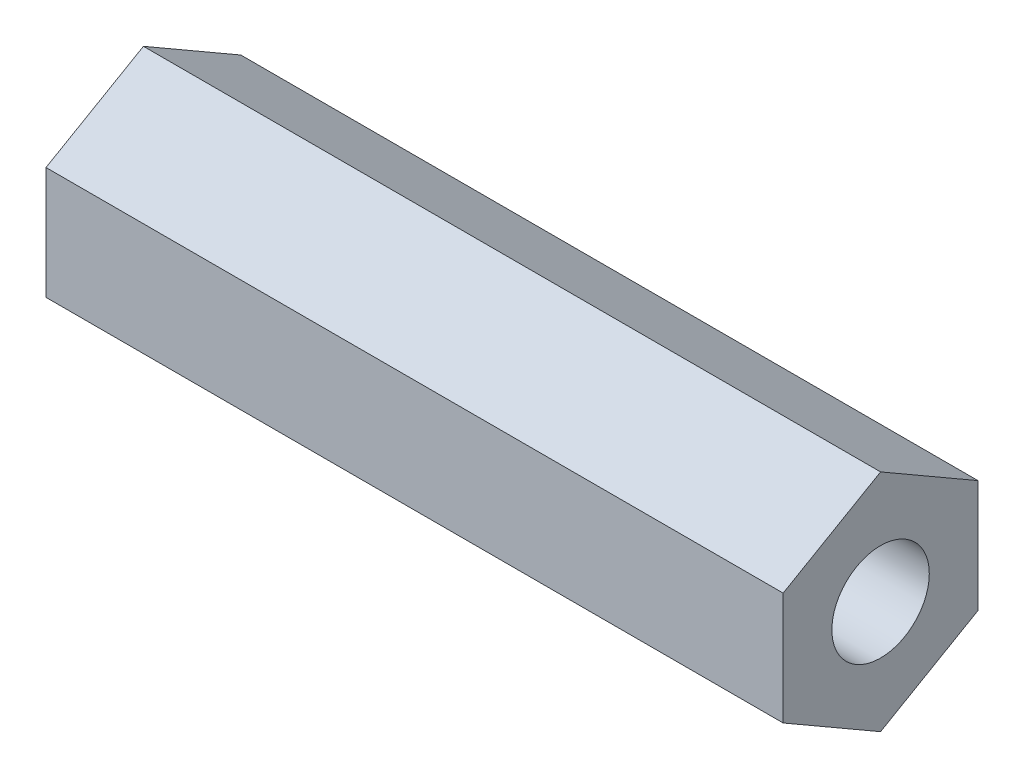
ISO-10303-21;
HEADER;
FILE_DESCRIPTION(('STEP AP214'),'2;1');
FILE_NAME('part.step','',(''),(''),'','','');
FILE_SCHEMA(('AUTOMOTIVE_DESIGN { 1 0 10303 214 1 1 1 1 }'));
ENDSEC;
DATA;
#1=APPLICATION_CONTEXT('core data for automotive mechanical design processes');
#2=APPLICATION_PROTOCOL_DEFINITION('international standard','automotive_design',2000,#1);
#3=PRODUCT_CONTEXT('',#1,'mechanical');
#4=PRODUCT('Part','Part','',(#3));
#5=PRODUCT_RELATED_PRODUCT_CATEGORY('part','',(#4));
#6=PRODUCT_DEFINITION_FORMATION('','',#4);
#7=PRODUCT_DEFINITION_CONTEXT('part definition',#1,'design');
#8=PRODUCT_DEFINITION('design','',#6,#7);
#9=PRODUCT_DEFINITION_SHAPE('','',#8);
#10=(LENGTH_UNIT() NAMED_UNIT(*) SI_UNIT(.MILLI.,.METRE.));
#11=(NAMED_UNIT(*) PLANE_ANGLE_UNIT() SI_UNIT($,.RADIAN.));
#12=(NAMED_UNIT(*) SI_UNIT($,.STERADIAN.) SOLID_ANGLE_UNIT());
#13=UNCERTAINTY_MEASURE_WITH_UNIT(LENGTH_MEASURE(1.E-05),#10,'distance_accuracy_value','');
#14=(GEOMETRIC_REPRESENTATION_CONTEXT(3) GLOBAL_UNCERTAINTY_ASSIGNED_CONTEXT((#13)) GLOBAL_UNIT_ASSIGNED_CONTEXT((#10,
#11,#12)) REPRESENTATION_CONTEXT('',''));
#15=CARTESIAN_POINT('',(0.,0.,0.));
#16=DIRECTION('',(0.,0.,1.));
#17=DIRECTION('',(1.,0.,0.));
#18=AXIS2_PLACEMENT_3D('',#15,#16,#17);
#19=CARTESIAN_POINT('',(22.7,0.,0.));
#20=DIRECTION('',(1.,0.,0.));
#21=DIRECTION('',(0.,0.,-1.));
#22=AXIS2_PLACEMENT_3D('',#19,#20,#21);
#23=PLANE('',#22);
#24=DIRECTION('',(0.,0.5,0.866025403784438));
#25=VECTOR('',#24,1.);
#26=CARTESIAN_POINT('',(22.7,6.54507984553655,39.7283363635929));
#27=LINE('',#26,#25);
#28=CARTESIAN_POINT('',(22.7,6.54507984553655,39.7283363635929));
#29=VERTEX_POINT('',#28);
#30=CARTESIAN_POINT('',(22.7,8.27713065310544,42.7283363635929));
#31=VERTEX_POINT('',#30);
#32=EDGE_CURVE('E146',#29,#31,#27,.T.);
#33=ORIENTED_EDGE('',*,*,#32,.T.);
#34=DIRECTION('',(0.,-0.500000000000001,0.866025403784438));
#35=VECTOR('',#34,1.);
#36=CARTESIAN_POINT('',(22.7,8.27713065310544,42.7283363635929));
#37=LINE('',#36,#35);
#38=CARTESIAN_POINT('',(22.7,6.54507984553656,45.7283363635929));
#39=VERTEX_POINT('',#38);
#40=EDGE_CURVE('E94',#31,#39,#37,.T.);
#41=ORIENTED_EDGE('',*,*,#40,.T.);
#42=DIRECTION('',(0.,-1.,0.));
#43=VECTOR('',#42,1.);
#44=CARTESIAN_POINT('',(22.7,6.54507984553656,45.7283363635929));
#45=LINE('',#44,#43);
#46=CARTESIAN_POINT('',(22.7,3.08097823039881,45.7283363635929));
#47=VERTEX_POINT('',#46);
#48=EDGE_CURVE('E107',#39,#47,#45,.T.);
#49=ORIENTED_EDGE('',*,*,#48,.T.);
#50=DIRECTION('',(0.,-0.5,-0.866025403784439));
#51=VECTOR('',#50,1.);
#52=CARTESIAN_POINT('',(22.7,3.08097823039881,45.7283363635929));
#53=LINE('',#52,#51);
#54=CARTESIAN_POINT('',(22.7,1.34892742282993,42.7283363635929));
#55=VERTEX_POINT('',#54);
#56=EDGE_CURVE('E101',#47,#55,#53,.T.);
#57=ORIENTED_EDGE('',*,*,#56,.T.);
#58=DIRECTION('',(0.,0.5,-0.866025403784439));
#59=VECTOR('',#58,1.);
#60=CARTESIAN_POINT('',(22.7,1.34892742282993,42.7283363635929));
#61=LINE('',#60,#59);
#62=CARTESIAN_POINT('',(22.7,3.0809782303988,39.7283363635929));
#63=VERTEX_POINT('',#62);
#64=EDGE_CURVE('E105',#55,#63,#61,.T.);
#65=ORIENTED_EDGE('',*,*,#64,.T.);
#66=DIRECTION('',(0.,1.,0.));
#67=VECTOR('',#66,1.);
#68=CARTESIAN_POINT('',(22.7,3.0809782303988,39.7283363635929));
#69=LINE('',#68,#67);
#70=EDGE_CURVE('E57',#63,#29,#69,.T.);
#71=ORIENTED_EDGE('',*,*,#70,.T.);
#72=EDGE_LOOP('',(#33,#41,#49,#57,#65,#71));
#73=FACE_BOUND('',#72,.T.);
#74=CARTESIAN_POINT('',(22.7,4.81302903796769,42.7283363635929));
#75=DIRECTION('',(1.,0.,0.));
#76=DIRECTION('',(0.,0.,-1.));
#77=AXIS2_PLACEMENT_3D('',#74,#75,#76);
#78=CIRCLE('',#77,1.5);
#79=CARTESIAN_POINT('',(22.7,4.81302903796769,41.2283363635929));
#80=VERTEX_POINT('',#79);
#81=EDGE_CURVE('E134',#80,#80,#78,.T.);
#82=ORIENTED_EDGE('',*,*,#81,.F.);
#83=EDGE_LOOP('',(#82));
#84=FACE_BOUND('',#83,.T.);
#85=ADVANCED_FACE('F39',(#73,#84),#23,.T.);
#86=CARTESIAN_POINT('',(0.,0.,0.));
#87=DIRECTION('',(1.,0.,0.));
#88=DIRECTION('',(0.,0.,-1.));
#89=AXIS2_PLACEMENT_3D('',#86,#87,#88);
#90=PLANE('',#89);
#91=DIRECTION('',(0.,0.5,0.866025403784438));
#92=VECTOR('',#91,1.);
#93=CARTESIAN_POINT('',(0.,6.54507984553655,39.7283363635929));
#94=LINE('',#93,#92);
#95=CARTESIAN_POINT('',(0.,6.54507984553655,39.7283363635929));
#96=VERTEX_POINT('',#95);
#97=CARTESIAN_POINT('',(0.,8.27713065310544,42.7283363635929));
#98=VERTEX_POINT('',#97);
#99=EDGE_CURVE('E129',#96,#98,#94,.T.);
#100=ORIENTED_EDGE('',*,*,#99,.F.);
#101=DIRECTION('',(0.,1.,0.));
#102=VECTOR('',#101,1.);
#103=CARTESIAN_POINT('',(0.,3.0809782303988,39.7283363635929));
#104=LINE('',#103,#102);
#105=CARTESIAN_POINT('',(0.,3.0809782303988,39.7283363635929));
#106=VERTEX_POINT('',#105);
#107=EDGE_CURVE('E86',#106,#96,#104,.T.);
#108=ORIENTED_EDGE('',*,*,#107,.F.);
#109=DIRECTION('',(0.,0.5,-0.866025403784439));
#110=VECTOR('',#109,1.);
#111=CARTESIAN_POINT('',(0.,1.34892742282993,42.7283363635929));
#112=LINE('',#111,#110);
#113=CARTESIAN_POINT('',(0.,1.34892742282993,42.7283363635929));
#114=VERTEX_POINT('',#113);
#115=EDGE_CURVE('E80',#114,#106,#112,.T.);
#116=ORIENTED_EDGE('',*,*,#115,.F.);
#117=DIRECTION('',(0.,-0.5,-0.866025403784439));
#118=VECTOR('',#117,1.);
#119=CARTESIAN_POINT('',(0.,3.08097823039881,45.7283363635929));
#120=LINE('',#119,#118);
#121=CARTESIAN_POINT('',(0.,3.08097823039881,45.7283363635929));
#122=VERTEX_POINT('',#121);
#123=EDGE_CURVE('E116',#122,#114,#120,.T.);
#124=ORIENTED_EDGE('',*,*,#123,.F.);
#125=DIRECTION('',(0.,-1.,0.));
#126=VECTOR('',#125,1.);
#127=CARTESIAN_POINT('',(0.,6.54507984553656,45.7283363635929));
#128=LINE('',#127,#126);
#129=CARTESIAN_POINT('',(0.,6.54507984553656,45.7283363635929));
#130=VERTEX_POINT('',#129);
#131=EDGE_CURVE('E137',#130,#122,#128,.T.);
#132=ORIENTED_EDGE('',*,*,#131,.F.);
#133=DIRECTION('',(0.,-0.500000000000001,0.866025403784438));
#134=VECTOR('',#133,1.);
#135=CARTESIAN_POINT('',(0.,8.27713065310544,42.7283363635929));
#136=LINE('',#135,#134);
#137=EDGE_CURVE('E133',#98,#130,#136,.T.);
#138=ORIENTED_EDGE('',*,*,#137,.F.);
#139=EDGE_LOOP('',(#100,#108,#116,#124,#132,#138));
#140=FACE_BOUND('',#139,.T.);
#141=CARTESIAN_POINT('',(0.,4.81302903796769,42.7283363635929));
#142=DIRECTION('',(1.,0.,0.));
#143=DIRECTION('',(0.,0.,-1.));
#144=AXIS2_PLACEMENT_3D('',#141,#142,#143);
#145=CIRCLE('',#144,1.5);
#146=CARTESIAN_POINT('',(0.,4.81302903796769,41.2283363635929));
#147=VERTEX_POINT('',#146);
#148=EDGE_CURVE('E243',#147,#147,#145,.T.);
#149=ORIENTED_EDGE('',*,*,#148,.T.);
#150=EDGE_LOOP('',(#149));
#151=FACE_BOUND('',#150,.T.);
#152=ADVANCED_FACE('F159',(#140,#151),#90,.F.);
#153=CARTESIAN_POINT('',(22.7,6.54507984553655,39.7283363635929));
#154=DIRECTION('',(0.,-0.866025403784438,0.5));
#155=DIRECTION('',(0.,-0.5,-0.866025403784439));
#156=AXIS2_PLACEMENT_3D('',#153,#154,#155);
#157=PLANE('',#156);
#158=ORIENTED_EDGE('',*,*,#99,.T.);
#159=DIRECTION('',(-1.,0.,0.));
#160=VECTOR('',#159,1.);
#161=CARTESIAN_POINT('',(22.7,8.27713065310544,42.7283363635929));
#162=LINE('',#161,#160);
#163=EDGE_CURVE('E11',#31,#98,#162,.T.);
#164=ORIENTED_EDGE('',*,*,#163,.F.);
#165=ORIENTED_EDGE('',*,*,#32,.F.);
#166=DIRECTION('',(-1.,0.,0.));
#167=VECTOR('',#166,1.);
#168=CARTESIAN_POINT('',(22.7,6.54507984553655,39.7283363635929));
#169=LINE('',#168,#167);
#170=EDGE_CURVE('E125',#29,#96,#169,.T.);
#171=ORIENTED_EDGE('',*,*,#170,.T.);
#172=EDGE_LOOP('',(#158,#164,#165,#171));
#173=FACE_BOUND('',#172,.T.);
#174=ADVANCED_FACE('F41',(#173),#157,.F.);
#175=CARTESIAN_POINT('',(22.7,8.27713065310544,42.7283363635929));
#176=DIRECTION('',(0.,-0.866025403784438,-0.500000000000001));
#177=DIRECTION('',(0.,0.500000000000001,-0.866025403784438));
#178=AXIS2_PLACEMENT_3D('',#175,#176,#177);
#179=PLANE('',#178);
#180=ORIENTED_EDGE('',*,*,#137,.T.);
#181=DIRECTION('',(-1.,0.,0.));
#182=VECTOR('',#181,1.);
#183=CARTESIAN_POINT('',(22.7,6.54507984553656,45.7283363635929));
#184=LINE('',#183,#182);
#185=EDGE_CURVE('E49',#39,#130,#184,.T.);
#186=ORIENTED_EDGE('',*,*,#185,.F.);
#187=ORIENTED_EDGE('',*,*,#40,.F.);
#188=ORIENTED_EDGE('',*,*,#163,.T.);
#189=EDGE_LOOP('',(#180,#186,#187,#188));
#190=FACE_BOUND('',#189,.T.);
#191=ADVANCED_FACE('F184',(#190),#179,.F.);
#192=CARTESIAN_POINT('',(22.7,6.54507984553656,45.7283363635929));
#193=DIRECTION('',(0.,0.,-1.));
#194=DIRECTION('',(-1.,0.,0.));
#195=AXIS2_PLACEMENT_3D('',#192,#193,#194);
#196=PLANE('',#195);
#197=ORIENTED_EDGE('',*,*,#131,.T.);
#198=DIRECTION('',(-1.,0.,0.));
#199=VECTOR('',#198,1.);
#200=CARTESIAN_POINT('',(22.7,3.08097823039881,45.7283363635929));
#201=LINE('',#200,#199);
#202=EDGE_CURVE('E118',#47,#122,#201,.T.);
#203=ORIENTED_EDGE('',*,*,#202,.F.);
#204=ORIENTED_EDGE('',*,*,#48,.F.);
#205=ORIENTED_EDGE('',*,*,#185,.T.);
#206=EDGE_LOOP('',(#197,#203,#204,#205));
#207=FACE_BOUND('',#206,.T.);
#208=ADVANCED_FACE('F156',(#207),#196,.F.);
#209=CARTESIAN_POINT('',(22.7,3.08097823039881,45.7283363635929));
#210=DIRECTION('',(0.,0.866025403784439,-0.5));
#211=DIRECTION('',(0.,0.5,0.866025403784439));
#212=AXIS2_PLACEMENT_3D('',#209,#210,#211);
#213=PLANE('',#212);
#214=ORIENTED_EDGE('',*,*,#123,.T.);
#215=DIRECTION('',(-1.,0.,0.));
#216=VECTOR('',#215,1.);
#217=CARTESIAN_POINT('',(22.7,1.34892742282993,42.7283363635929));
#218=LINE('',#217,#216);
#219=EDGE_CURVE('E113',#55,#114,#218,.T.);
#220=ORIENTED_EDGE('',*,*,#219,.F.);
#221=ORIENTED_EDGE('',*,*,#56,.F.);
#222=ORIENTED_EDGE('',*,*,#202,.T.);
#223=EDGE_LOOP('',(#214,#220,#221,#222));
#224=FACE_BOUND('',#223,.T.);
#225=ADVANCED_FACE('F114',(#224),#213,.F.);
#226=CARTESIAN_POINT('',(22.7,1.34892742282993,42.7283363635929));
#227=DIRECTION('',(0.,0.866025403784439,0.5));
#228=DIRECTION('',(0.,-0.5,0.866025403784439));
#229=AXIS2_PLACEMENT_3D('',#226,#227,#228);
#230=PLANE('',#229);
#231=ORIENTED_EDGE('',*,*,#115,.T.);
#232=DIRECTION('',(-1.,0.,0.));
#233=VECTOR('',#232,1.);
#234=CARTESIAN_POINT('',(22.7,3.0809782303988,39.7283363635929));
#235=LINE('',#234,#233);
#236=EDGE_CURVE('E119',#63,#106,#235,.T.);
#237=ORIENTED_EDGE('',*,*,#236,.F.);
#238=ORIENTED_EDGE('',*,*,#64,.F.);
#239=ORIENTED_EDGE('',*,*,#219,.T.);
#240=EDGE_LOOP('',(#231,#237,#238,#239));
#241=FACE_BOUND('',#240,.T.);
#242=ADVANCED_FACE('F121',(#241),#230,.F.);
#243=CARTESIAN_POINT('',(22.7,3.0809782303988,39.7283363635929));
#244=DIRECTION('',(0.,0.,1.));
#245=DIRECTION('',(1.,0.,0.));
#246=AXIS2_PLACEMENT_3D('',#243,#244,#245);
#247=PLANE('',#246);
#248=ORIENTED_EDGE('',*,*,#107,.T.);
#249=ORIENTED_EDGE('',*,*,#170,.F.);
#250=ORIENTED_EDGE('',*,*,#70,.F.);
#251=ORIENTED_EDGE('',*,*,#236,.T.);
#252=EDGE_LOOP('',(#248,#249,#250,#251));
#253=FACE_BOUND('',#252,.T.);
#254=ADVANCED_FACE('F164',(#253),#247,.F.);
#255=CARTESIAN_POINT('',(22.7,4.81302903796769,42.7283363635929));
#256=DIRECTION('',(-1.,0.,0.));
#257=DIRECTION('',(0.,0.,1.));
#258=AXIS2_PLACEMENT_3D('',#255,#256,#257);
#259=CYLINDRICAL_SURFACE('',#258,1.5);
#260=ORIENTED_EDGE('',*,*,#81,.T.);
#261=EDGE_LOOP('',(#260));
#262=FACE_BOUND('',#261,.T.);
#263=ORIENTED_EDGE('',*,*,#148,.F.);
#264=EDGE_LOOP('',(#263));
#265=FACE_BOUND('',#264,.T.);
#266=ADVANCED_FACE('F166',(#262,#265),#259,.F.);
#267=CLOSED_SHELL('',(#85,#152,#174,#191,#208,#225,#242,#254,#266));
#268=MANIFOLD_SOLID_BREP('B2',#267);
#269=ADVANCED_BREP_SHAPE_REPRESENTATION('',(#18,#268),#14);
#270=SHAPE_DEFINITION_REPRESENTATION(#9,#269);
ENDSEC;
END-ISO-10303-21;
